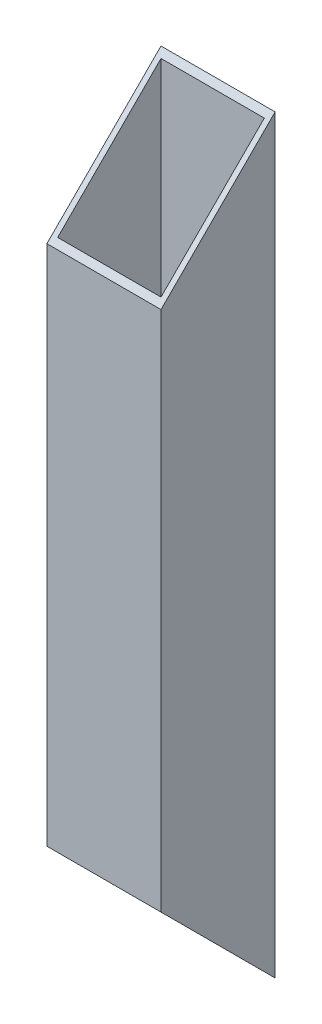
ISO-10303-21;
HEADER;
FILE_DESCRIPTION(('STEP AP214'),'2;1');
FILE_NAME('part.step','',(''),(''),'','','');
FILE_SCHEMA(('AUTOMOTIVE_DESIGN { 1 0 10303 214 1 1 1 1 }'));
ENDSEC;
DATA;
#1=APPLICATION_CONTEXT('core data for automotive mechanical design processes');
#2=APPLICATION_PROTOCOL_DEFINITION('international standard','automotive_design',2000,#1);
#3=PRODUCT_CONTEXT('',#1,'mechanical');
#4=PRODUCT('Part','Part','',(#3));
#5=PRODUCT_RELATED_PRODUCT_CATEGORY('part','',(#4));
#6=PRODUCT_DEFINITION_FORMATION('','',#4);
#7=PRODUCT_DEFINITION_CONTEXT('part definition',#1,'design');
#8=PRODUCT_DEFINITION('design','',#6,#7);
#9=PRODUCT_DEFINITION_SHAPE('','',#8);
#10=(LENGTH_UNIT() NAMED_UNIT(*) SI_UNIT(.MILLI.,.METRE.));
#11=(NAMED_UNIT(*) PLANE_ANGLE_UNIT() SI_UNIT($,.RADIAN.));
#12=(NAMED_UNIT(*) SI_UNIT($,.STERADIAN.) SOLID_ANGLE_UNIT());
#13=UNCERTAINTY_MEASURE_WITH_UNIT(LENGTH_MEASURE(1.E-05),#10,'distance_accuracy_value','');
#14=(GEOMETRIC_REPRESENTATION_CONTEXT(3) GLOBAL_UNCERTAINTY_ASSIGNED_CONTEXT((#13)) GLOBAL_UNIT_ASSIGNED_CONTEXT((#10,
#11,#12)) REPRESENTATION_CONTEXT('',''));
#15=CARTESIAN_POINT('',(0.,0.,0.));
#16=DIRECTION('',(0.,0.,1.));
#17=DIRECTION('',(1.,0.,0.));
#18=AXIS2_PLACEMENT_3D('',#15,#16,#17);
#19=CARTESIAN_POINT('',(24.2,166.94,-1.2));
#20=DIRECTION('',(-1.,0.,0.));
#21=DIRECTION('',(0.,0.,1.));
#22=AXIS2_PLACEMENT_3D('',#19,#20,#21);
#23=PLANE('',#22);
#24=DIRECTION('',(0.,-0.707106781186548,0.707106781186547));
#25=VECTOR('',#24,1.);
#26=CARTESIAN_POINT('',(24.2,154.84,-13.3));
#27=LINE('',#26,#25);
#28=CARTESIAN_POINT('',(24.2,165.74,-24.2));
#29=VERTEX_POINT('',#28);
#30=CARTESIAN_POINT('',(24.2,142.74,-1.2));
#31=VERTEX_POINT('',#30);
#32=EDGE_CURVE('E11',#29,#31,#27,.T.);
#33=ORIENTED_EDGE('',*,*,#32,.F.);
#34=DIRECTION('',(0.,-1.,0.));
#35=VECTOR('',#34,1.);
#36=CARTESIAN_POINT('',(24.2,166.94,-24.2));
#37=LINE('',#36,#35);
#38=CARTESIAN_POINT('',(24.2,1.20000000000001,-24.2));
#39=VERTEX_POINT('',#38);
#40=EDGE_CURVE('E159',#29,#39,#37,.T.);
#41=ORIENTED_EDGE('',*,*,#40,.T.);
#42=DIRECTION('',(0.,-0.707106781186547,-0.707106781186548));
#43=VECTOR('',#42,1.);
#44=CARTESIAN_POINT('',(24.2,95.57,70.17));
#45=LINE('',#44,#43);
#46=CARTESIAN_POINT('',(24.2,24.2,-1.2));
#47=VERTEX_POINT('',#46);
#48=EDGE_CURVE('E52',#47,#39,#45,.T.);
#49=ORIENTED_EDGE('',*,*,#48,.F.);
#50=DIRECTION('',(0.,-1.,0.));
#51=VECTOR('',#50,1.);
#52=CARTESIAN_POINT('',(24.2,166.94,-1.2));
#53=LINE('',#52,#51);
#54=EDGE_CURVE('E167',#31,#47,#53,.T.);
#55=ORIENTED_EDGE('',*,*,#54,.F.);
#56=EDGE_LOOP('',(#33,#41,#49,#55));
#57=FACE_BOUND('',#56,.T.);
#58=ADVANCED_FACE('F43',(#57),#23,.T.);
#59=CARTESIAN_POINT('',(1.2,166.94,-1.2));
#60=DIRECTION('',(0.,0.,-1.));
#61=DIRECTION('',(-1.,0.,0.));
#62=AXIS2_PLACEMENT_3D('',#59,#60,#61);
#63=PLANE('',#62);
#64=DIRECTION('',(-1.,0.,0.));
#65=VECTOR('',#64,1.);
#66=CARTESIAN_POINT('',(1.2,142.74,-1.2));
#67=LINE('',#66,#65);
#68=CARTESIAN_POINT('',(1.2,142.74,-1.2));
#69=VERTEX_POINT('',#68);
#70=EDGE_CURVE('E163',#31,#69,#67,.T.);
#71=ORIENTED_EDGE('',*,*,#70,.F.);
#72=ORIENTED_EDGE('',*,*,#54,.T.);
#73=DIRECTION('',(1.,0.,0.));
#74=VECTOR('',#73,1.);
#75=CARTESIAN_POINT('',(1.2,24.2,-1.2));
#76=LINE('',#75,#74);
#77=CARTESIAN_POINT('',(1.2,24.2,-1.2));
#78=VERTEX_POINT('',#77);
#79=EDGE_CURVE('E66',#78,#47,#76,.T.);
#80=ORIENTED_EDGE('',*,*,#79,.F.);
#81=DIRECTION('',(0.,-1.,0.));
#82=VECTOR('',#81,1.);
#83=CARTESIAN_POINT('',(1.2,166.94,-1.2));
#84=LINE('',#83,#82);
#85=EDGE_CURVE('E171',#69,#78,#84,.T.);
#86=ORIENTED_EDGE('',*,*,#85,.F.);
#87=EDGE_LOOP('',(#71,#72,#80,#86));
#88=FACE_BOUND('',#87,.T.);
#89=ADVANCED_FACE('F188',(#88),#63,.T.);
#90=CARTESIAN_POINT('',(1.2,166.94,-24.2));
#91=DIRECTION('',(1.,0.,0.));
#92=DIRECTION('',(0.,0.,-1.));
#93=AXIS2_PLACEMENT_3D('',#90,#91,#92);
#94=PLANE('',#93);
#95=DIRECTION('',(0.,0.707106781186548,-0.707106781186547));
#96=VECTOR('',#95,1.);
#97=CARTESIAN_POINT('',(1.2,166.34,-24.8));
#98=LINE('',#97,#96);
#99=CARTESIAN_POINT('',(1.2,165.74,-24.2));
#100=VERTEX_POINT('',#99);
#101=EDGE_CURVE('E173',#69,#100,#98,.T.);
#102=ORIENTED_EDGE('',*,*,#101,.F.);
#103=ORIENTED_EDGE('',*,*,#85,.T.);
#104=DIRECTION('',(0.,0.707106781186547,0.707106781186548));
#105=VECTOR('',#104,1.);
#106=CARTESIAN_POINT('',(1.20000000000001,84.07,58.67));
#107=LINE('',#106,#105);
#108=CARTESIAN_POINT('',(1.2,1.20000000000003,-24.2));
#109=VERTEX_POINT('',#108);
#110=EDGE_CURVE('E164',#109,#78,#107,.T.);
#111=ORIENTED_EDGE('',*,*,#110,.F.);
#112=DIRECTION('',(0.,-1.,0.));
#113=VECTOR('',#112,1.);
#114=CARTESIAN_POINT('',(1.2,166.94,-24.2));
#115=LINE('',#114,#113);
#116=EDGE_CURVE('E161',#100,#109,#115,.T.);
#117=ORIENTED_EDGE('',*,*,#116,.F.);
#118=EDGE_LOOP('',(#102,#103,#111,#117));
#119=FACE_BOUND('',#118,.T.);
#120=ADVANCED_FACE('F185',(#119),#94,.T.);
#121=CARTESIAN_POINT('',(24.2,166.94,-24.2));
#122=DIRECTION('',(0.,0.,1.));
#123=DIRECTION('',(1.,0.,0.));
#124=AXIS2_PLACEMENT_3D('',#121,#122,#123);
#125=PLANE('',#124);
#126=DIRECTION('',(1.,0.,0.));
#127=VECTOR('',#126,1.);
#128=CARTESIAN_POINT('',(24.2,165.74,-24.2));
#129=LINE('',#128,#127);
#130=EDGE_CURVE('E58',#100,#29,#129,.T.);
#131=ORIENTED_EDGE('',*,*,#130,.F.);
#132=ORIENTED_EDGE('',*,*,#116,.T.);
#133=DIRECTION('',(-1.,0.,0.));
#134=VECTOR('',#133,1.);
#135=CARTESIAN_POINT('',(24.2,1.20000000000003,-24.2));
#136=LINE('',#135,#134);
#137=EDGE_CURVE('E149',#39,#109,#136,.T.);
#138=ORIENTED_EDGE('',*,*,#137,.F.);
#139=ORIENTED_EDGE('',*,*,#40,.F.);
#140=EDGE_LOOP('',(#131,#132,#138,#139));
#141=FACE_BOUND('',#140,.T.);
#142=ADVANCED_FACE('F158',(#141),#125,.T.);
#143=CARTESIAN_POINT('',(0.,25.4,0.));
#144=DIRECTION('',(0.,0.707106781186548,-0.707106781186547));
#145=DIRECTION('',(0.,0.707106781186547,0.707106781186548));
#146=AXIS2_PLACEMENT_3D('',#143,#144,#145);
#147=PLANE('',#146);
#148=ORIENTED_EDGE('',*,*,#137,.T.);
#149=ORIENTED_EDGE('',*,*,#110,.T.);
#150=ORIENTED_EDGE('',*,*,#79,.T.);
#151=ORIENTED_EDGE('',*,*,#48,.T.);
#152=EDGE_LOOP('',(#148,#149,#150,#151));
#153=FACE_BOUND('',#152,.T.);
#154=DIRECTION('',(0.,0.707106781186547,0.707106781186548));
#155=VECTOR('',#154,1.);
#156=CARTESIAN_POINT('',(25.4,25.4,0.));
#157=LINE('',#156,#155);
#158=CARTESIAN_POINT('',(25.4,0.,-25.4));
#159=VERTEX_POINT('',#158);
#160=CARTESIAN_POINT('',(25.4,25.4,0.));
#161=VERTEX_POINT('',#160);
#162=EDGE_CURVE('E233',#159,#161,#157,.T.);
#163=ORIENTED_EDGE('',*,*,#162,.T.);
#164=DIRECTION('',(1.,0.,0.));
#165=VECTOR('',#164,1.);
#166=CARTESIAN_POINT('',(0.,25.4,0.));
#167=LINE('',#166,#165);
#168=CARTESIAN_POINT('',(0.,25.4,0.));
#169=VERTEX_POINT('',#168);
#170=EDGE_CURVE('E231',#169,#161,#167,.T.);
#171=ORIENTED_EDGE('',*,*,#170,.F.);
#172=DIRECTION('',(0.,0.707106781186547,0.707106781186548));
#173=VECTOR('',#172,1.);
#174=CARTESIAN_POINT('',(0.,25.4,0.));
#175=LINE('',#174,#173);
#176=CARTESIAN_POINT('',(0.,0.,-25.4));
#177=VERTEX_POINT('',#176);
#178=EDGE_CURVE('E196',#177,#169,#175,.T.);
#179=ORIENTED_EDGE('',*,*,#178,.F.);
#180=DIRECTION('',(-1.,0.,0.));
#181=VECTOR('',#180,1.);
#182=CARTESIAN_POINT('',(25.4,0.,-25.4));
#183=LINE('',#182,#181);
#184=EDGE_CURVE('E120',#159,#177,#183,.T.);
#185=ORIENTED_EDGE('',*,*,#184,.F.);
#186=EDGE_LOOP('',(#163,#171,#179,#185));
#187=FACE_BOUND('',#186,.T.);
#188=ADVANCED_FACE('F147',(#153,#187),#147,.F.);
#189=CARTESIAN_POINT('',(0.,141.54,0.));
#190=DIRECTION('',(0.,-0.707106781186547,-0.707106781186548));
#191=DIRECTION('',(0.,0.707106781186548,-0.707106781186547));
#192=AXIS2_PLACEMENT_3D('',#189,#190,#191);
#193=PLANE('',#192);
#194=ORIENTED_EDGE('',*,*,#130,.T.);
#195=ORIENTED_EDGE('',*,*,#32,.T.);
#196=ORIENTED_EDGE('',*,*,#70,.T.);
#197=ORIENTED_EDGE('',*,*,#101,.T.);
#198=EDGE_LOOP('',(#194,#195,#196,#197));
#199=FACE_BOUND('',#198,.T.);
#200=DIRECTION('',(0.,0.707106781186548,-0.707106781186547));
#201=VECTOR('',#200,1.);
#202=CARTESIAN_POINT('',(25.4,141.54,0.));
#203=LINE('',#202,#201);
#204=CARTESIAN_POINT('',(25.4,141.54,0.));
#205=VERTEX_POINT('',#204);
#206=CARTESIAN_POINT('',(25.4,166.94,-25.4));
#207=VERTEX_POINT('',#206);
#208=EDGE_CURVE('E113',#205,#207,#203,.T.);
#209=ORIENTED_EDGE('',*,*,#208,.T.);
#210=DIRECTION('',(-1.,0.,0.));
#211=VECTOR('',#210,1.);
#212=CARTESIAN_POINT('',(25.4,166.94,-25.4));
#213=LINE('',#212,#211);
#214=CARTESIAN_POINT('',(0.,166.94,-25.4));
#215=VERTEX_POINT('',#214);
#216=EDGE_CURVE('E107',#207,#215,#213,.T.);
#217=ORIENTED_EDGE('',*,*,#216,.T.);
#218=DIRECTION('',(0.,0.707106781186548,-0.707106781186547));
#219=VECTOR('',#218,1.);
#220=CARTESIAN_POINT('',(0.,141.54,0.));
#221=LINE('',#220,#219);
#222=CARTESIAN_POINT('',(0.,141.54,0.));
#223=VERTEX_POINT('',#222);
#224=EDGE_CURVE('E110',#223,#215,#221,.T.);
#225=ORIENTED_EDGE('',*,*,#224,.F.);
#226=DIRECTION('',(1.,0.,0.));
#227=VECTOR('',#226,1.);
#228=CARTESIAN_POINT('',(0.,141.54,0.));
#229=LINE('',#228,#227);
#230=EDGE_CURVE('E129',#223,#205,#229,.T.);
#231=ORIENTED_EDGE('',*,*,#230,.T.);
#232=EDGE_LOOP('',(#209,#217,#225,#231));
#233=FACE_BOUND('',#232,.T.);
#234=ADVANCED_FACE('F109',(#199,#233),#193,.F.);
#235=CARTESIAN_POINT('',(0.,166.94,-25.4));
#236=DIRECTION('',(1.,0.,0.));
#237=DIRECTION('',(0.,0.,-1.));
#238=AXIS2_PLACEMENT_3D('',#235,#236,#237);
#239=PLANE('',#238);
#240=DIRECTION('',(0.,-1.,0.));
#241=VECTOR('',#240,1.);
#242=CARTESIAN_POINT('',(0.,166.94,0.));
#243=LINE('',#242,#241);
#244=EDGE_CURVE('E127',#223,#169,#243,.T.);
#245=ORIENTED_EDGE('',*,*,#244,.F.);
#246=ORIENTED_EDGE('',*,*,#224,.T.);
#247=DIRECTION('',(0.,-1.,0.));
#248=VECTOR('',#247,1.);
#249=CARTESIAN_POINT('',(0.,166.94,-25.4));
#250=LINE('',#249,#248);
#251=EDGE_CURVE('E119',#215,#177,#250,.T.);
#252=ORIENTED_EDGE('',*,*,#251,.T.);
#253=ORIENTED_EDGE('',*,*,#178,.T.);
#254=EDGE_LOOP('',(#245,#246,#252,#253));
#255=FACE_BOUND('',#254,.T.);
#256=ADVANCED_FACE('F45',(#255),#239,.F.);
#257=CARTESIAN_POINT('',(0.,166.94,0.));
#258=DIRECTION('',(0.,0.,-1.));
#259=DIRECTION('',(-1.,0.,0.));
#260=AXIS2_PLACEMENT_3D('',#257,#258,#259);
#261=PLANE('',#260);
#262=DIRECTION('',(0.,-1.,0.));
#263=VECTOR('',#262,1.);
#264=CARTESIAN_POINT('',(25.4,166.94,0.));
#265=LINE('',#264,#263);
#266=EDGE_CURVE('E137',#205,#161,#265,.T.);
#267=ORIENTED_EDGE('',*,*,#266,.F.);
#268=ORIENTED_EDGE('',*,*,#230,.F.);
#269=ORIENTED_EDGE('',*,*,#244,.T.);
#270=ORIENTED_EDGE('',*,*,#170,.T.);
#271=EDGE_LOOP('',(#267,#268,#269,#270));
#272=FACE_BOUND('',#271,.T.);
#273=ADVANCED_FACE('F207',(#272),#261,.F.);
#274=CARTESIAN_POINT('',(25.4,166.94,0.));
#275=DIRECTION('',(-1.,0.,0.));
#276=DIRECTION('',(0.,0.,1.));
#277=AXIS2_PLACEMENT_3D('',#274,#275,#276);
#278=PLANE('',#277);
#279=DIRECTION('',(0.,-1.,0.));
#280=VECTOR('',#279,1.);
#281=CARTESIAN_POINT('',(25.4,166.94,-25.4));
#282=LINE('',#281,#280);
#283=EDGE_CURVE('E134',#207,#159,#282,.T.);
#284=ORIENTED_EDGE('',*,*,#283,.F.);
#285=ORIENTED_EDGE('',*,*,#208,.F.);
#286=ORIENTED_EDGE('',*,*,#266,.T.);
#287=ORIENTED_EDGE('',*,*,#162,.F.);
#288=EDGE_LOOP('',(#284,#285,#286,#287));
#289=FACE_BOUND('',#288,.T.);
#290=ADVANCED_FACE('F222',(#289),#278,.F.);
#291=CARTESIAN_POINT('',(25.4,166.94,-25.4));
#292=DIRECTION('',(0.,0.,1.));
#293=DIRECTION('',(1.,0.,0.));
#294=AXIS2_PLACEMENT_3D('',#291,#292,#293);
#295=PLANE('',#294);
#296=ORIENTED_EDGE('',*,*,#184,.T.);
#297=ORIENTED_EDGE('',*,*,#251,.F.);
#298=ORIENTED_EDGE('',*,*,#216,.F.);
#299=ORIENTED_EDGE('',*,*,#283,.T.);
#300=EDGE_LOOP('',(#296,#297,#298,#299));
#301=FACE_BOUND('',#300,.T.);
#302=ADVANCED_FACE('F132',(#301),#295,.F.);
#303=CLOSED_SHELL('',(#58,#89,#120,#142,#188,#234,#256,#273,#290,#302));
#304=MANIFOLD_SOLID_BREP('B2',#303);
#305=ADVANCED_BREP_SHAPE_REPRESENTATION('',(#18,#304),#14);
#306=SHAPE_DEFINITION_REPRESENTATION(#9,#305);
ENDSEC;
END-ISO-10303-21;
